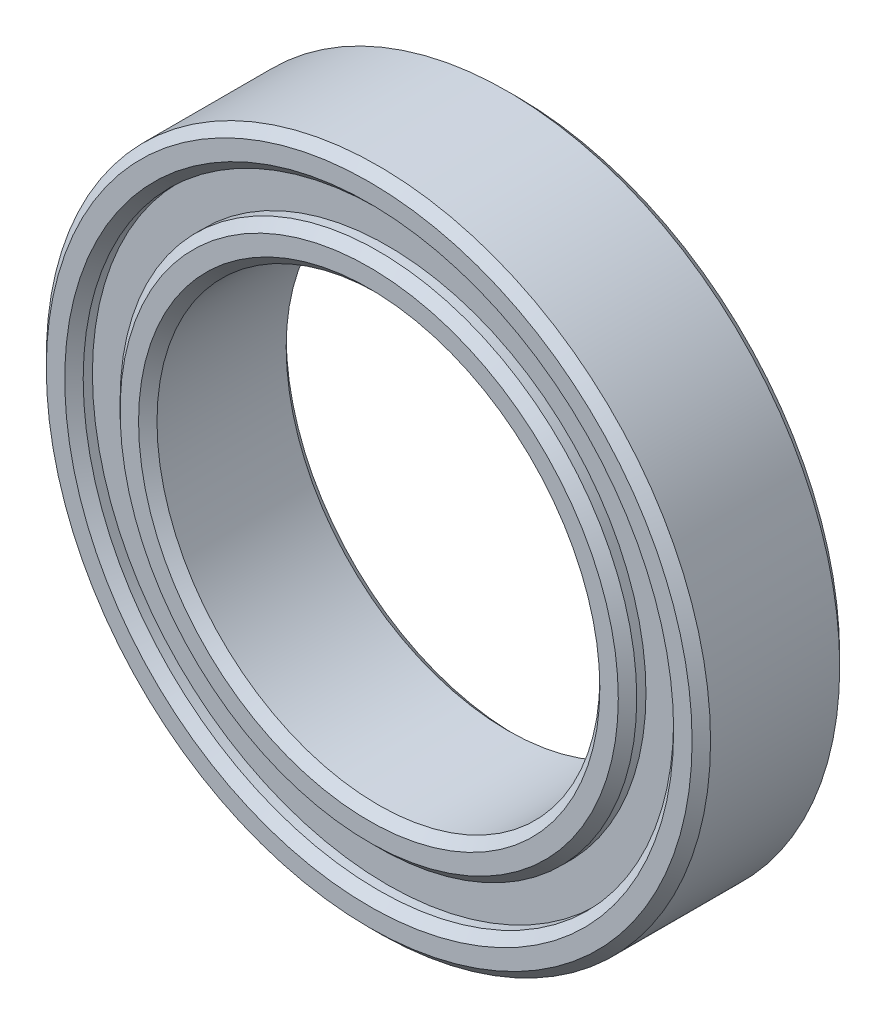
ISO-10303-21;
HEADER;
FILE_DESCRIPTION(('STEP AP214'),'2;1');
FILE_NAME('part.step','',(''),(''),'','','');
FILE_SCHEMA(('AUTOMOTIVE_DESIGN { 1 0 10303 214 1 1 1 1 }'));
ENDSEC;
DATA;
#1=APPLICATION_CONTEXT('core data for automotive mechanical design processes');
#2=APPLICATION_PROTOCOL_DEFINITION('international standard','automotive_design',2000,#1);
#3=PRODUCT_CONTEXT('',#1,'mechanical');
#4=PRODUCT('Part','Part','',(#3));
#5=PRODUCT_RELATED_PRODUCT_CATEGORY('part','',(#4));
#6=PRODUCT_DEFINITION_FORMATION('','',#4);
#7=PRODUCT_DEFINITION_CONTEXT('part definition',#1,'design');
#8=PRODUCT_DEFINITION('design','',#6,#7);
#9=PRODUCT_DEFINITION_SHAPE('','',#8);
#10=(LENGTH_UNIT() NAMED_UNIT(*) SI_UNIT(.MILLI.,.METRE.));
#11=(NAMED_UNIT(*) PLANE_ANGLE_UNIT() SI_UNIT($,.RADIAN.));
#12=(NAMED_UNIT(*) SI_UNIT($,.STERADIAN.) SOLID_ANGLE_UNIT());
#13=UNCERTAINTY_MEASURE_WITH_UNIT(LENGTH_MEASURE(1.E-05),#10,'distance_accuracy_value','');
#14=(GEOMETRIC_REPRESENTATION_CONTEXT(3) GLOBAL_UNCERTAINTY_ASSIGNED_CONTEXT((#13)) GLOBAL_UNIT_ASSIGNED_CONTEXT((#10,
#11,#12)) REPRESENTATION_CONTEXT('',''));
#15=CARTESIAN_POINT('',(0.,0.,0.));
#16=DIRECTION('',(0.,0.,1.));
#17=DIRECTION('',(1.,0.,0.));
#18=AXIS2_PLACEMENT_3D('',#15,#16,#17);
#19=CARTESIAN_POINT('',(0.,0.,4.));
#20=DIRECTION('',(0.,0.,1.));
#21=DIRECTION('',(1.,0.,0.));
#22=AXIS2_PLACEMENT_3D('',#19,#20,#21);
#23=PLANE('',#22);
#24=CARTESIAN_POINT('',(0.,0.,4.));
#25=DIRECTION('',(0.,0.,1.));
#26=DIRECTION('',(1.,0.,0.));
#27=AXIS2_PLACEMENT_3D('',#24,#25,#26);
#28=CIRCLE('',#27,6.75);
#29=CARTESIAN_POINT('',(6.75,0.,4.));
#30=VERTEX_POINT('',#29);
#31=EDGE_CURVE('E80',#30,#30,#28,.T.);
#32=ORIENTED_EDGE('',*,*,#31,.T.);
#33=EDGE_LOOP('',(#32));
#34=FACE_BOUND('',#33,.T.);
#35=CARTESIAN_POINT('',(0.,0.,4.));
#36=DIRECTION('',(0.,0.,1.));
#37=DIRECTION('',(1.,0.,0.));
#38=AXIS2_PLACEMENT_3D('',#35,#36,#37);
#39=CIRCLE('',#38,6.25);
#40=CARTESIAN_POINT('',(6.25,0.,4.));
#41=VERTEX_POINT('',#40);
#42=EDGE_CURVE('E100',#41,#41,#39,.F.);
#43=ORIENTED_EDGE('',*,*,#42,.T.);
#44=EDGE_LOOP('',(#43));
#45=FACE_BOUND('',#44,.T.);
#46=ADVANCED_FACE('F43',(#34,#45),#23,.T.);
#47=CARTESIAN_POINT('',(0.,0.,0.));
#48=DIRECTION('',(0.,0.,1.));
#49=DIRECTION('',(1.,0.,0.));
#50=AXIS2_PLACEMENT_3D('',#47,#48,#49);
#51=PLANE('',#50);
#52=CARTESIAN_POINT('',(0.,0.,0.));
#53=DIRECTION('',(0.,0.,1.));
#54=DIRECTION('',(1.,0.,0.));
#55=AXIS2_PLACEMENT_3D('',#52,#53,#54);
#56=CIRCLE('',#55,6.75);
#57=CARTESIAN_POINT('',(6.75,0.,0.));
#58=VERTEX_POINT('',#57);
#59=EDGE_CURVE('E62',#58,#58,#56,.F.);
#60=ORIENTED_EDGE('',*,*,#59,.T.);
#61=EDGE_LOOP('',(#60));
#62=FACE_BOUND('',#61,.T.);
#63=CARTESIAN_POINT('',(0.,0.,0.));
#64=DIRECTION('',(0.,0.,1.));
#65=DIRECTION('',(1.,0.,0.));
#66=AXIS2_PLACEMENT_3D('',#63,#64,#65);
#67=CIRCLE('',#66,6.25000000000001);
#68=CARTESIAN_POINT('',(6.25000000000001,0.,0.));
#69=VERTEX_POINT('',#68);
#70=EDGE_CURVE('E88',#69,#69,#67,.T.);
#71=ORIENTED_EDGE('',*,*,#70,.T.);
#72=EDGE_LOOP('',(#71));
#73=FACE_BOUND('',#72,.T.);
#74=ADVANCED_FACE('F153',(#62,#73),#51,.F.);
#75=CARTESIAN_POINT('',(0.,0.,4.));
#76=DIRECTION('',(0.,0.,1.));
#77=DIRECTION('',(1.,0.,0.));
#78=AXIS2_PLACEMENT_3D('',#75,#76,#77);
#79=CIRCLE('',#78,8.25000000000001);
#80=CARTESIAN_POINT('',(8.25000000000001,0.,4.));
#81=VERTEX_POINT('',#80);
#82=EDGE_CURVE('E68',#81,#81,#79,.F.);
#83=ORIENTED_EDGE('',*,*,#82,.T.);
#84=EDGE_LOOP('',(#83));
#85=FACE_BOUND('',#84,.T.);
#86=CARTESIAN_POINT('',(0.,0.,4.));
#87=DIRECTION('',(0.,0.,1.));
#88=DIRECTION('',(1.,0.,0.));
#89=AXIS2_PLACEMENT_3D('',#86,#87,#88);
#90=CIRCLE('',#89,8.74999999999999);
#91=CARTESIAN_POINT('',(8.74999999999999,0.,4.));
#92=VERTEX_POINT('',#91);
#93=EDGE_CURVE('E104',#92,#92,#90,.T.);
#94=ORIENTED_EDGE('',*,*,#93,.T.);
#95=EDGE_LOOP('',(#94));
#96=FACE_BOUND('',#95,.T.);
#97=ADVANCED_FACE('F156',(#85,#96),#23,.T.);
#98=CARTESIAN_POINT('',(0.,0.,0.));
#99=DIRECTION('',(0.,0.,1.));
#100=DIRECTION('',(1.,0.,0.));
#101=AXIS2_PLACEMENT_3D('',#98,#99,#100);
#102=CIRCLE('',#101,8.25000000000001);
#103=CARTESIAN_POINT('',(8.25000000000001,0.,0.));
#104=VERTEX_POINT('',#103);
#105=EDGE_CURVE('E10',#104,#104,#102,.T.);
#106=ORIENTED_EDGE('',*,*,#105,.T.);
#107=EDGE_LOOP('',(#106));
#108=FACE_BOUND('',#107,.T.);
#109=CARTESIAN_POINT('',(0.,0.,0.));
#110=DIRECTION('',(0.,0.,1.));
#111=DIRECTION('',(1.,0.,0.));
#112=AXIS2_PLACEMENT_3D('',#109,#110,#111);
#113=CIRCLE('',#112,8.75);
#114=CARTESIAN_POINT('',(8.75,0.,0.));
#115=VERTEX_POINT('',#114);
#116=EDGE_CURVE('E84',#115,#115,#113,.F.);
#117=ORIENTED_EDGE('',*,*,#116,.T.);
#118=EDGE_LOOP('',(#117));
#119=FACE_BOUND('',#118,.T.);
#120=ADVANCED_FACE('F162',(#108,#119),#51,.F.);
#121=CARTESIAN_POINT('',(0.,0.,4.));
#122=DIRECTION('',(0.,0.,-1.));
#123=DIRECTION('',(-1.,0.,0.));
#124=AXIS2_PLACEMENT_3D('',#121,#122,#123);
#125=CYLINDRICAL_SURFACE('',#124,9.);
#126=CARTESIAN_POINT('',(0.,0.,3.75));
#127=DIRECTION('',(0.,0.,1.));
#128=DIRECTION('',(1.,0.,0.));
#129=AXIS2_PLACEMENT_3D('',#126,#127,#128);
#130=CIRCLE('',#129,9.);
#131=CARTESIAN_POINT('',(9.,0.,3.75));
#132=VERTEX_POINT('',#131);
#133=EDGE_CURVE('E92',#132,#132,#130,.F.);
#134=ORIENTED_EDGE('',*,*,#133,.T.);
#135=EDGE_LOOP('',(#134));
#136=FACE_BOUND('',#135,.T.);
#137=CARTESIAN_POINT('',(0.,0.,0.25));
#138=DIRECTION('',(0.,0.,1.));
#139=DIRECTION('',(1.,0.,0.));
#140=AXIS2_PLACEMENT_3D('',#137,#138,#139);
#141=CIRCLE('',#140,9.);
#142=CARTESIAN_POINT('',(9.,0.,0.25));
#143=VERTEX_POINT('',#142);
#144=EDGE_CURVE('E96',#143,#143,#141,.T.);
#145=ORIENTED_EDGE('',*,*,#144,.T.);
#146=EDGE_LOOP('',(#145));
#147=FACE_BOUND('',#146,.T.);
#148=ADVANCED_FACE('F170',(#136,#147),#125,.T.);
#149=CARTESIAN_POINT('',(0.,0.,4.));
#150=DIRECTION('',(0.,0.,-1.));
#151=DIRECTION('',(-1.,0.,0.));
#152=AXIS2_PLACEMENT_3D('',#149,#150,#151);
#153=CYLINDRICAL_SURFACE('',#152,6.);
#154=CARTESIAN_POINT('',(0.,0.,3.75));
#155=DIRECTION('',(0.,0.,1.));
#156=DIRECTION('',(1.,0.,0.));
#157=AXIS2_PLACEMENT_3D('',#154,#155,#156);
#158=CIRCLE('',#157,6.);
#159=CARTESIAN_POINT('',(6.,0.,3.75));
#160=VERTEX_POINT('',#159);
#161=EDGE_CURVE('E108',#160,#160,#158,.T.);
#162=ORIENTED_EDGE('',*,*,#161,.T.);
#163=EDGE_LOOP('',(#162));
#164=FACE_BOUND('',#163,.T.);
#165=CARTESIAN_POINT('',(0.,0.,0.250000000000004));
#166=DIRECTION('',(0.,0.,1.));
#167=DIRECTION('',(1.,0.,0.));
#168=AXIS2_PLACEMENT_3D('',#165,#166,#167);
#169=CIRCLE('',#168,6.);
#170=CARTESIAN_POINT('',(6.,0.,0.250000000000004));
#171=VERTEX_POINT('',#170);
#172=EDGE_CURVE('E112',#171,#171,#169,.F.);
#173=ORIENTED_EDGE('',*,*,#172,.T.);
#174=EDGE_LOOP('',(#173));
#175=FACE_BOUND('',#174,.T.);
#176=ADVANCED_FACE('F188',(#164,#175),#153,.F.);
#177=CARTESIAN_POINT('',(0.,0.,3.75));
#178=DIRECTION('',(0.,0.,1.));
#179=DIRECTION('',(1.,0.,0.));
#180=AXIS2_PLACEMENT_3D('',#177,#178,#179);
#181=CONICAL_SURFACE('',#180,6.,0.785398163397455);
#182=ORIENTED_EDGE('',*,*,#42,.F.);
#183=EDGE_LOOP('',(#182));
#184=FACE_BOUND('',#183,.T.);
#185=ORIENTED_EDGE('',*,*,#161,.F.);
#186=EDGE_LOOP('',(#185));
#187=FACE_BOUND('',#186,.T.);
#188=ADVANCED_FACE('F178',(#184,#187),#181,.F.);
#189=CARTESIAN_POINT('',(0.,0.,4.));
#190=DIRECTION('',(0.,0.,-1.));
#191=DIRECTION('',(-1.,0.,0.));
#192=AXIS2_PLACEMENT_3D('',#189,#190,#191);
#193=CONICAL_SURFACE('',#192,8.74999999999999,0.785398163397448);
#194=ORIENTED_EDGE('',*,*,#133,.F.);
#195=EDGE_LOOP('',(#194));
#196=FACE_BOUND('',#195,.T.);
#197=ORIENTED_EDGE('',*,*,#93,.F.);
#198=EDGE_LOOP('',(#197));
#199=FACE_BOUND('',#198,.T.);
#200=ADVANCED_FACE('F175',(#196,#199),#193,.T.);
#201=CARTESIAN_POINT('',(0.,0.,0.25));
#202=DIRECTION('',(0.,0.,1.));
#203=DIRECTION('',(1.,0.,0.));
#204=AXIS2_PLACEMENT_3D('',#201,#202,#203);
#205=CONICAL_SURFACE('',#204,9.,0.785398163397452);
#206=ORIENTED_EDGE('',*,*,#116,.F.);
#207=EDGE_LOOP('',(#206));
#208=FACE_BOUND('',#207,.T.);
#209=ORIENTED_EDGE('',*,*,#144,.F.);
#210=EDGE_LOOP('',(#209));
#211=FACE_BOUND('',#210,.T.);
#212=ADVANCED_FACE('F177',(#208,#211),#205,.T.);
#213=CARTESIAN_POINT('',(0.,0.,0.));
#214=DIRECTION('',(0.,0.,-1.));
#215=DIRECTION('',(-1.,0.,0.));
#216=AXIS2_PLACEMENT_3D('',#213,#214,#215);
#217=CONICAL_SURFACE('',#216,6.25000000000001,0.78539816339745);
#218=ORIENTED_EDGE('',*,*,#172,.F.);
#219=EDGE_LOOP('',(#218));
#220=FACE_BOUND('',#219,.T.);
#221=ORIENTED_EDGE('',*,*,#70,.F.);
#222=EDGE_LOOP('',(#221));
#223=FACE_BOUND('',#222,.T.);
#224=ADVANCED_FACE('F185',(#220,#223),#217,.F.);
#225=CARTESIAN_POINT('',(0.,0.,0.5));
#226=DIRECTION('',(0.,0.,-1.));
#227=DIRECTION('',(-1.,0.,0.));
#228=AXIS2_PLACEMENT_3D('',#225,#226,#227);
#229=CYLINDRICAL_SURFACE('',#228,8.);
#230=CARTESIAN_POINT('',(0.,0.,0.250000000000007));
#231=DIRECTION('',(0.,0.,1.));
#232=DIRECTION('',(1.,0.,0.));
#233=AXIS2_PLACEMENT_3D('',#230,#231,#232);
#234=CIRCLE('',#233,8.);
#235=CARTESIAN_POINT('',(8.,0.,0.250000000000007));
#236=VERTEX_POINT('',#235);
#237=EDGE_CURVE('E52',#236,#236,#234,.F.);
#238=ORIENTED_EDGE('',*,*,#237,.T.);
#239=EDGE_LOOP('',(#238));
#240=FACE_BOUND('',#239,.T.);
#241=CARTESIAN_POINT('',(0.,0.,0.5));
#242=DIRECTION('',(0.,0.,-1.));
#243=DIRECTION('',(-1.,0.,0.));
#244=AXIS2_PLACEMENT_3D('',#241,#242,#243);
#245=CIRCLE('',#244,8.);
#246=CARTESIAN_POINT('',(-8.,0.,0.5));
#247=VERTEX_POINT('',#246);
#248=EDGE_CURVE('E116',#247,#247,#245,.T.);
#249=ORIENTED_EDGE('',*,*,#248,.F.);
#250=EDGE_LOOP('',(#249));
#251=FACE_BOUND('',#250,.T.);
#252=ADVANCED_FACE('F207',(#240,#251),#229,.F.);
#253=CARTESIAN_POINT('',(0.,0.,0.5));
#254=DIRECTION('',(0.,0.,-1.));
#255=DIRECTION('',(-1.,0.,0.));
#256=AXIS2_PLACEMENT_3D('',#253,#254,#255);
#257=PLANE('',#256);
#258=CARTESIAN_POINT('',(0.,0.,0.5));
#259=DIRECTION('',(0.,0.,-1.));
#260=DIRECTION('',(-1.,0.,0.));
#261=AXIS2_PLACEMENT_3D('',#258,#259,#260);
#262=CIRCLE('',#261,7.);
#263=CARTESIAN_POINT('',(-7.,0.,0.5));
#264=VERTEX_POINT('',#263);
#265=EDGE_CURVE('E120',#264,#264,#262,.T.);
#266=ORIENTED_EDGE('',*,*,#265,.F.);
#267=EDGE_LOOP('',(#266));
#268=FACE_BOUND('',#267,.T.);
#269=ORIENTED_EDGE('',*,*,#248,.T.);
#270=EDGE_LOOP('',(#269));
#271=FACE_BOUND('',#270,.T.);
#272=ADVANCED_FACE('F149',(#268,#271),#257,.T.);
#273=CARTESIAN_POINT('',(0.,0.,0.5));
#274=DIRECTION('',(0.,0.,-1.));
#275=DIRECTION('',(-1.,0.,0.));
#276=AXIS2_PLACEMENT_3D('',#273,#274,#275);
#277=CYLINDRICAL_SURFACE('',#276,7.);
#278=CARTESIAN_POINT('',(0.,0.,0.250000000000005));
#279=DIRECTION('',(0.,0.,1.));
#280=DIRECTION('',(1.,0.,0.));
#281=AXIS2_PLACEMENT_3D('',#278,#279,#280);
#282=CIRCLE('',#281,7.);
#283=CARTESIAN_POINT('',(7.,0.,0.250000000000005));
#284=VERTEX_POINT('',#283);
#285=EDGE_CURVE('E57',#284,#284,#282,.T.);
#286=ORIENTED_EDGE('',*,*,#285,.T.);
#287=EDGE_LOOP('',(#286));
#288=FACE_BOUND('',#287,.T.);
#289=ORIENTED_EDGE('',*,*,#265,.T.);
#290=EDGE_LOOP('',(#289));
#291=FACE_BOUND('',#290,.T.);
#292=ADVANCED_FACE('F143',(#288,#291),#277,.T.);
#293=CARTESIAN_POINT('',(0.,0.,3.5));
#294=DIRECTION('',(0.,0.,1.));
#295=DIRECTION('',(1.,0.,0.));
#296=AXIS2_PLACEMENT_3D('',#293,#294,#295);
#297=CYLINDRICAL_SURFACE('',#296,8.);
#298=CARTESIAN_POINT('',(0.,0.,3.74999999999999));
#299=DIRECTION('',(0.,0.,1.));
#300=DIRECTION('',(1.,0.,0.));
#301=AXIS2_PLACEMENT_3D('',#298,#299,#300);
#302=CIRCLE('',#301,8.);
#303=CARTESIAN_POINT('',(8.,0.,3.74999999999999));
#304=VERTEX_POINT('',#303);
#305=EDGE_CURVE('E72',#304,#304,#302,.T.);
#306=ORIENTED_EDGE('',*,*,#305,.T.);
#307=EDGE_LOOP('',(#306));
#308=FACE_BOUND('',#307,.T.);
#309=CARTESIAN_POINT('',(0.,0.,3.5));
#310=DIRECTION('',(0.,0.,1.));
#311=DIRECTION('',(1.,0.,0.));
#312=AXIS2_PLACEMENT_3D('',#309,#310,#311);
#313=CIRCLE('',#312,8.);
#314=CARTESIAN_POINT('',(8.,0.,3.5));
#315=VERTEX_POINT('',#314);
#316=EDGE_CURVE('E124',#315,#315,#313,.T.);
#317=ORIENTED_EDGE('',*,*,#316,.F.);
#318=EDGE_LOOP('',(#317));
#319=FACE_BOUND('',#318,.T.);
#320=ADVANCED_FACE('F138',(#308,#319),#297,.F.);
#321=CARTESIAN_POINT('',(0.,0.,3.5));
#322=DIRECTION('',(0.,0.,1.));
#323=DIRECTION('',(1.,0.,0.));
#324=AXIS2_PLACEMENT_3D('',#321,#322,#323);
#325=PLANE('',#324);
#326=CARTESIAN_POINT('',(0.,0.,3.5));
#327=DIRECTION('',(0.,0.,1.));
#328=DIRECTION('',(1.,0.,0.));
#329=AXIS2_PLACEMENT_3D('',#326,#327,#328);
#330=CIRCLE('',#329,7.);
#331=CARTESIAN_POINT('',(7.,0.,3.5));
#332=VERTEX_POINT('',#331);
#333=EDGE_CURVE('E128',#332,#332,#330,.T.);
#334=ORIENTED_EDGE('',*,*,#333,.F.);
#335=EDGE_LOOP('',(#334));
#336=FACE_BOUND('',#335,.T.);
#337=ORIENTED_EDGE('',*,*,#316,.T.);
#338=EDGE_LOOP('',(#337));
#339=FACE_BOUND('',#338,.T.);
#340=ADVANCED_FACE('F135',(#336,#339),#325,.T.);
#341=CARTESIAN_POINT('',(0.,0.,3.5));
#342=DIRECTION('',(0.,0.,1.));
#343=DIRECTION('',(1.,0.,0.));
#344=AXIS2_PLACEMENT_3D('',#341,#342,#343);
#345=CYLINDRICAL_SURFACE('',#344,7.);
#346=CARTESIAN_POINT('',(0.,0.,3.75));
#347=DIRECTION('',(0.,0.,1.));
#348=DIRECTION('',(1.,0.,0.));
#349=AXIS2_PLACEMENT_3D('',#346,#347,#348);
#350=CIRCLE('',#349,7.);
#351=CARTESIAN_POINT('',(7.,0.,3.75));
#352=VERTEX_POINT('',#351);
#353=EDGE_CURVE('E76',#352,#352,#350,.F.);
#354=ORIENTED_EDGE('',*,*,#353,.T.);
#355=EDGE_LOOP('',(#354));
#356=FACE_BOUND('',#355,.T.);
#357=ORIENTED_EDGE('',*,*,#333,.T.);
#358=EDGE_LOOP('',(#357));
#359=FACE_BOUND('',#358,.T.);
#360=ADVANCED_FACE('F133',(#356,#359),#345,.T.);
#361=CARTESIAN_POINT('',(0.,0.,4.));
#362=DIRECTION('',(0.,0.,-1.));
#363=DIRECTION('',(-1.,0.,0.));
#364=AXIS2_PLACEMENT_3D('',#361,#362,#363);
#365=CONICAL_SURFACE('',#364,6.75,0.785398163397441);
#366=ORIENTED_EDGE('',*,*,#353,.F.);
#367=EDGE_LOOP('',(#366));
#368=FACE_BOUND('',#367,.T.);
#369=ORIENTED_EDGE('',*,*,#31,.F.);
#370=EDGE_LOOP('',(#369));
#371=FACE_BOUND('',#370,.T.);
#372=ADVANCED_FACE('F209',(#368,#371),#365,.T.);
#373=CARTESIAN_POINT('',(0.,0.,3.74999999999999));
#374=DIRECTION('',(0.,0.,1.));
#375=DIRECTION('',(1.,0.,0.));
#376=AXIS2_PLACEMENT_3D('',#373,#374,#375);
#377=CONICAL_SURFACE('',#376,8.,0.785398163397448);
#378=ORIENTED_EDGE('',*,*,#82,.F.);
#379=EDGE_LOOP('',(#378));
#380=FACE_BOUND('',#379,.T.);
#381=ORIENTED_EDGE('',*,*,#305,.F.);
#382=EDGE_LOOP('',(#381));
#383=FACE_BOUND('',#382,.T.);
#384=ADVANCED_FACE('F215',(#380,#383),#377,.F.);
#385=CARTESIAN_POINT('',(0.,0.,0.));
#386=DIRECTION('',(0.,0.,1.));
#387=DIRECTION('',(1.,0.,0.));
#388=AXIS2_PLACEMENT_3D('',#385,#386,#387);
#389=CONICAL_SURFACE('',#388,6.75,0.785398163397441);
#390=ORIENTED_EDGE('',*,*,#285,.F.);
#391=EDGE_LOOP('',(#390));
#392=FACE_BOUND('',#391,.T.);
#393=ORIENTED_EDGE('',*,*,#59,.F.);
#394=EDGE_LOOP('',(#393));
#395=FACE_BOUND('',#394,.T.);
#396=ADVANCED_FACE('F221',(#392,#395),#389,.T.);
#397=CARTESIAN_POINT('',(0.,0.,0.250000000000007));
#398=DIRECTION('',(0.,0.,-1.));
#399=DIRECTION('',(-1.,0.,0.));
#400=AXIS2_PLACEMENT_3D('',#397,#398,#399);
#401=CONICAL_SURFACE('',#400,8.,0.785398163397448);
#402=ORIENTED_EDGE('',*,*,#105,.F.);
#403=EDGE_LOOP('',(#402));
#404=FACE_BOUND('',#403,.T.);
#405=ORIENTED_EDGE('',*,*,#237,.F.);
#406=EDGE_LOOP('',(#405));
#407=FACE_BOUND('',#406,.T.);
#408=ADVANCED_FACE('F46',(#404,#407),#401,.F.);
#409=CLOSED_SHELL('',(#46,#74,#97,#120,#148,#176,#188,#200,#212,#224,#252,#272,#292,#320,#340,
#360,#372,#384,#396,#408));
#410=MANIFOLD_SOLID_BREP('B2',#409);
#411=ADVANCED_BREP_SHAPE_REPRESENTATION('',(#18,#410),#14);
#412=SHAPE_DEFINITION_REPRESENTATION(#9,#411);
ENDSEC;
END-ISO-10303-21;
